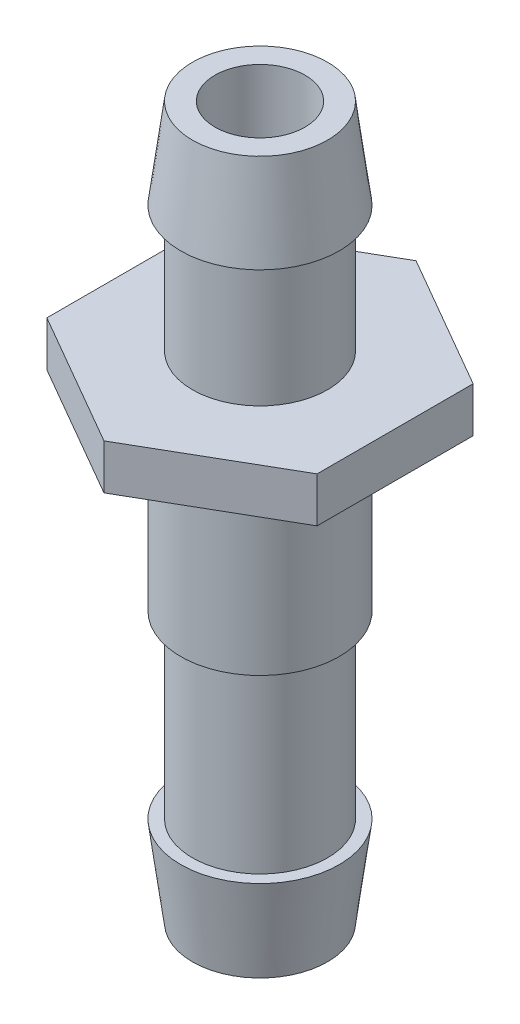
ISO-10303-21;
HEADER;
FILE_DESCRIPTION(('STEP AP214'),'2;1');
FILE_NAME('part.step','',(''),(''),'','','');
FILE_SCHEMA(('AUTOMOTIVE_DESIGN { 1 0 10303 214 1 1 1 1 }'));
ENDSEC;
DATA;
#1=APPLICATION_CONTEXT('core data for automotive mechanical design processes');
#2=APPLICATION_PROTOCOL_DEFINITION('international standard','automotive_design',2000,#1);
#3=PRODUCT_CONTEXT('',#1,'mechanical');
#4=PRODUCT('Part','Part','',(#3));
#5=PRODUCT_RELATED_PRODUCT_CATEGORY('part','',(#4));
#6=PRODUCT_DEFINITION_FORMATION('','',#4);
#7=PRODUCT_DEFINITION_CONTEXT('part definition',#1,'design');
#8=PRODUCT_DEFINITION('design','',#6,#7);
#9=PRODUCT_DEFINITION_SHAPE('','',#8);
#10=(LENGTH_UNIT() NAMED_UNIT(*) SI_UNIT(.MILLI.,.METRE.));
#11=(NAMED_UNIT(*) PLANE_ANGLE_UNIT() SI_UNIT($,.RADIAN.));
#12=(NAMED_UNIT(*) SI_UNIT($,.STERADIAN.) SOLID_ANGLE_UNIT());
#13=UNCERTAINTY_MEASURE_WITH_UNIT(LENGTH_MEASURE(1.E-05),#10,'distance_accuracy_value','');
#14=(GEOMETRIC_REPRESENTATION_CONTEXT(3) GLOBAL_UNCERTAINTY_ASSIGNED_CONTEXT((#13)) GLOBAL_UNIT_ASSIGNED_CONTEXT((#10,
#11,#12)) REPRESENTATION_CONTEXT('',''));
#15=CARTESIAN_POINT('',(0.,0.,0.));
#16=DIRECTION('',(0.,0.,1.));
#17=DIRECTION('',(1.,0.,0.));
#18=AXIS2_PLACEMENT_3D('',#15,#16,#17);
#19=CARTESIAN_POINT('',(0.,-34.925,0.));
#20=DIRECTION('',(0.,1.,0.));
#21=DIRECTION('',(0.,0.,1.));
#22=AXIS2_PLACEMENT_3D('',#19,#20,#21);
#23=CYLINDRICAL_SURFACE('',#22,4.7625);
#24=CARTESIAN_POINT('',(0.,-15.875,0.));
#25=DIRECTION('',(0.,-1.,0.));
#26=DIRECTION('',(0.,0.,-1.));
#27=AXIS2_PLACEMENT_3D('',#24,#25,#26);
#28=CIRCLE('',#27,4.7625);
#29=CARTESIAN_POINT('',(0.,-15.875,-4.7625));
#30=VERTEX_POINT('',#29);
#31=EDGE_CURVE('E254',#30,#30,#28,.T.);
#32=ORIENTED_EDGE('',*,*,#31,.T.);
#33=EDGE_LOOP('',(#32));
#34=FACE_BOUND('',#33,.T.);
#35=CARTESIAN_POINT('',(0.,-28.575,0.));
#36=DIRECTION('',(0.,-1.,0.));
#37=DIRECTION('',(0.,0.,-1.));
#38=AXIS2_PLACEMENT_3D('',#35,#36,#37);
#39=CIRCLE('',#38,4.7625);
#40=CARTESIAN_POINT('',(0.,-28.575,-4.7625));
#41=VERTEX_POINT('',#40);
#42=EDGE_CURVE('E11',#41,#41,#39,.T.);
#43=ORIENTED_EDGE('',*,*,#42,.F.);
#44=EDGE_LOOP('',(#43));
#45=FACE_BOUND('',#44,.T.);
#46=ADVANCED_FACE('F34',(#34,#45),#23,.T.);
#47=CARTESIAN_POINT('',(0.,15.24,0.));
#48=DIRECTION('',(0.,-1.,0.));
#49=DIRECTION('',(0.,0.,-1.));
#50=AXIS2_PLACEMENT_3D('',#47,#48,#49);
#51=CYLINDRICAL_SURFACE('',#50,4.7625);
#52=CARTESIAN_POINT('',(0.,0.,0.));
#53=DIRECTION('',(0.,1.,0.));
#54=DIRECTION('',(0.,0.,1.));
#55=AXIS2_PLACEMENT_3D('',#52,#53,#54);
#56=CIRCLE('',#55,4.7625);
#57=CARTESIAN_POINT('',(0.,0.,4.7625));
#58=VERTEX_POINT('',#57);
#59=EDGE_CURVE('E106',#58,#58,#56,.T.);
#60=ORIENTED_EDGE('',*,*,#59,.T.);
#61=EDGE_LOOP('',(#60));
#62=FACE_BOUND('',#61,.T.);
#63=CARTESIAN_POINT('',(0.,8.89,0.));
#64=DIRECTION('',(0.,1.,0.));
#65=DIRECTION('',(0.,0.,1.));
#66=AXIS2_PLACEMENT_3D('',#63,#64,#65);
#67=CIRCLE('',#66,4.7625);
#68=CARTESIAN_POINT('',(0.,8.89,4.7625));
#69=VERTEX_POINT('',#68);
#70=EDGE_CURVE('E42',#69,#69,#67,.T.);
#71=ORIENTED_EDGE('',*,*,#70,.F.);
#72=EDGE_LOOP('',(#71));
#73=FACE_BOUND('',#72,.T.);
#74=ADVANCED_FACE('F36',(#62,#73),#51,.T.);
#75=CARTESIAN_POINT('',(-19.05,-3.175,0.));
#76=DIRECTION('',(0.,1.,0.));
#77=DIRECTION('',(0.,0.,1.));
#78=AXIS2_PLACEMENT_3D('',#75,#76,#77);
#79=PLANE('',#78);
#80=CARTESIAN_POINT('',(0.,-3.175,0.));
#81=DIRECTION('',(0.,-1.,0.));
#82=DIRECTION('',(0.,0.,-1.));
#83=AXIS2_PLACEMENT_3D('',#80,#81,#82);
#84=CIRCLE('',#83,7.366);
#85=CARTESIAN_POINT('',(0.,-3.175,-7.366));
#86=VERTEX_POINT('',#85);
#87=EDGE_CURVE('E271',#86,#86,#84,.T.);
#88=ORIENTED_EDGE('',*,*,#87,.F.);
#89=EDGE_LOOP('',(#88));
#90=FACE_BOUND('',#89,.T.);
#91=DIRECTION('',(-0.866025403784439,0.,-0.5));
#92=VECTOR('',#91,1.);
#93=CARTESIAN_POINT('',(0.,-3.175,10.9985226280624));
#94=LINE('',#93,#92);
#95=CARTESIAN_POINT('',(0.,-3.175,10.9985226280624));
#96=VERTEX_POINT('',#95);
#97=CARTESIAN_POINT('',(-9.525,-3.175,5.49926131403119));
#98=VERTEX_POINT('',#97);
#99=EDGE_CURVE('E126',#96,#98,#94,.T.);
#100=ORIENTED_EDGE('',*,*,#99,.T.);
#101=DIRECTION('',(0.,0.,-1.));
#102=VECTOR('',#101,1.);
#103=CARTESIAN_POINT('',(-9.525,-3.175,5.49926131403119));
#104=LINE('',#103,#102);
#105=CARTESIAN_POINT('',(-9.525,-3.175,-5.49926131403118));
#106=VERTEX_POINT('',#105);
#107=EDGE_CURVE('E103',#98,#106,#104,.T.);
#108=ORIENTED_EDGE('',*,*,#107,.T.);
#109=DIRECTION('',(0.866025403784438,0.,-0.5));
#110=VECTOR('',#109,1.);
#111=CARTESIAN_POINT('',(0.,-3.175,-10.9985226280624));
#112=LINE('',#111,#110);
#113=CARTESIAN_POINT('',(0.,-3.175,-10.9985226280624));
#114=VERTEX_POINT('',#113);
#115=EDGE_CURVE('E129',#106,#114,#112,.T.);
#116=ORIENTED_EDGE('',*,*,#115,.T.);
#117=DIRECTION('',(0.866025403784438,0.,0.5));
#118=VECTOR('',#117,1.);
#119=CARTESIAN_POINT('',(0.,-3.175,-10.9985226280624));
#120=LINE('',#119,#118);
#121=CARTESIAN_POINT('',(9.525,-3.175,-5.49926131403118));
#122=VERTEX_POINT('',#121);
#123=EDGE_CURVE('E131',#114,#122,#120,.T.);
#124=ORIENTED_EDGE('',*,*,#123,.T.);
#125=DIRECTION('',(0.,0.,1.));
#126=VECTOR('',#125,1.);
#127=CARTESIAN_POINT('',(9.525,-3.175,5.49926131403119));
#128=LINE('',#127,#126);
#129=CARTESIAN_POINT('',(9.525,-3.175,5.49926131403119));
#130=VERTEX_POINT('',#129);
#131=EDGE_CURVE('E54',#122,#130,#128,.T.);
#132=ORIENTED_EDGE('',*,*,#131,.T.);
#133=DIRECTION('',(-0.866025403784439,0.,0.5));
#134=VECTOR('',#133,1.);
#135=CARTESIAN_POINT('',(0.,-3.175,10.9985226280624));
#136=LINE('',#135,#134);
#137=EDGE_CURVE('E49',#130,#96,#136,.T.);
#138=ORIENTED_EDGE('',*,*,#137,.T.);
#139=EDGE_LOOP('',(#100,#108,#116,#124,#132,#138));
#140=FACE_BOUND('',#139,.T.);
#141=ADVANCED_FACE('F157',(#90,#140),#79,.F.);
#142=CARTESIAN_POINT('',(0.,15.24,0.));
#143=DIRECTION('',(0.,1.,0.));
#144=DIRECTION('',(0.,0.,1.));
#145=AXIS2_PLACEMENT_3D('',#142,#143,#144);
#146=PLANE('',#145);
#147=CARTESIAN_POINT('',(0.,15.24,0.));
#148=DIRECTION('',(0.,1.,0.));
#149=DIRECTION('',(0.,0.,1.));
#150=AXIS2_PLACEMENT_3D('',#147,#148,#149);
#151=CIRCLE('',#150,4.7625);
#152=CARTESIAN_POINT('',(0.,15.24,4.7625));
#153=VERTEX_POINT('',#152);
#154=EDGE_CURVE('E206',#153,#153,#151,.T.);
#155=ORIENTED_EDGE('',*,*,#154,.T.);
#156=EDGE_LOOP('',(#155));
#157=FACE_BOUND('',#156,.T.);
#158=CARTESIAN_POINT('',(0.,15.24,0.));
#159=DIRECTION('',(0.,1.,0.));
#160=DIRECTION('',(0.,0.,1.));
#161=AXIS2_PLACEMENT_3D('',#158,#159,#160);
#162=CIRCLE('',#161,3.175);
#163=CARTESIAN_POINT('',(0.,15.24,3.175));
#164=VERTEX_POINT('',#163);
#165=EDGE_CURVE('E148',#164,#164,#162,.T.);
#166=ORIENTED_EDGE('',*,*,#165,.F.);
#167=EDGE_LOOP('',(#166));
#168=FACE_BOUND('',#167,.T.);
#169=ADVANCED_FACE('F163',(#157,#168),#146,.T.);
#170=CARTESIAN_POINT('',(0.,15.24,0.));
#171=DIRECTION('',(0.,-1.,0.));
#172=DIRECTION('',(0.,0.,-1.));
#173=AXIS2_PLACEMENT_3D('',#170,#171,#172);
#174=CYLINDRICAL_SURFACE('',#173,3.175);
#175=ORIENTED_EDGE('',*,*,#165,.T.);
#176=EDGE_LOOP('',(#175));
#177=FACE_BOUND('',#176,.T.);
#178=CARTESIAN_POINT('',(0.,-34.925,0.));
#179=DIRECTION('',(0.,-1.,0.));
#180=DIRECTION('',(0.,0.,-1.));
#181=AXIS2_PLACEMENT_3D('',#178,#179,#180);
#182=CIRCLE('',#181,3.175);
#183=CARTESIAN_POINT('',(0.,-34.925,-3.175));
#184=VERTEX_POINT('',#183);
#185=EDGE_CURVE('E112',#184,#184,#182,.T.);
#186=ORIENTED_EDGE('',*,*,#185,.T.);
#187=EDGE_LOOP('',(#186));
#188=FACE_BOUND('',#187,.T.);
#189=ADVANCED_FACE('F170',(#177,#188),#174,.F.);
#190=CARTESIAN_POINT('',(-19.05,0.,0.));
#191=DIRECTION('',(0.,1.,0.));
#192=DIRECTION('',(0.,0.,1.));
#193=AXIS2_PLACEMENT_3D('',#190,#191,#192);
#194=PLANE('',#193);
#195=DIRECTION('',(-0.866025403784439,0.,-0.5));
#196=VECTOR('',#195,1.);
#197=CARTESIAN_POINT('',(0.,0.,10.9985226280624));
#198=LINE('',#197,#196);
#199=CARTESIAN_POINT('',(0.,0.,10.9985226280624));
#200=VERTEX_POINT('',#199);
#201=CARTESIAN_POINT('',(-9.525,0.,5.49926131403119));
#202=VERTEX_POINT('',#201);
#203=EDGE_CURVE('E93',#200,#202,#198,.T.);
#204=ORIENTED_EDGE('',*,*,#203,.F.);
#205=DIRECTION('',(-0.866025403784439,0.,0.5));
#206=VECTOR('',#205,1.);
#207=CARTESIAN_POINT('',(0.,0.,10.9985226280624));
#208=LINE('',#207,#206);
#209=CARTESIAN_POINT('',(9.525,0.,5.49926131403119));
#210=VERTEX_POINT('',#209);
#211=EDGE_CURVE('E124',#210,#200,#208,.T.);
#212=ORIENTED_EDGE('',*,*,#211,.F.);
#213=DIRECTION('',(0.,0.,1.));
#214=VECTOR('',#213,1.);
#215=CARTESIAN_POINT('',(9.525,0.,5.49926131403119));
#216=LINE('',#215,#214);
#217=CARTESIAN_POINT('',(9.525,0.,-5.49926131403118));
#218=VERTEX_POINT('',#217);
#219=EDGE_CURVE('E122',#218,#210,#216,.T.);
#220=ORIENTED_EDGE('',*,*,#219,.F.);
#221=DIRECTION('',(0.866025403784438,0.,0.5));
#222=VECTOR('',#221,1.);
#223=CARTESIAN_POINT('',(0.,0.,-10.9985226280624));
#224=LINE('',#223,#222);
#225=CARTESIAN_POINT('',(0.,0.,-10.9985226280624));
#226=VERTEX_POINT('',#225);
#227=EDGE_CURVE('E120',#226,#218,#224,.T.);
#228=ORIENTED_EDGE('',*,*,#227,.F.);
#229=DIRECTION('',(0.866025403784438,0.,-0.5));
#230=VECTOR('',#229,1.);
#231=CARTESIAN_POINT('',(0.,0.,-10.9985226280624));
#232=LINE('',#231,#230);
#233=CARTESIAN_POINT('',(-9.525,0.,-5.49926131403118));
#234=VERTEX_POINT('',#233);
#235=EDGE_CURVE('E95',#234,#226,#232,.T.);
#236=ORIENTED_EDGE('',*,*,#235,.F.);
#237=DIRECTION('',(0.,0.,-1.));
#238=VECTOR('',#237,1.);
#239=CARTESIAN_POINT('',(-9.525,0.,5.49926131403119));
#240=LINE('',#239,#238);
#241=EDGE_CURVE('E87',#202,#234,#240,.T.);
#242=ORIENTED_EDGE('',*,*,#241,.F.);
#243=EDGE_LOOP('',(#204,#212,#220,#228,#236,#242));
#244=FACE_BOUND('',#243,.T.);
#245=ORIENTED_EDGE('',*,*,#59,.F.);
#246=EDGE_LOOP('',(#245));
#247=FACE_BOUND('',#246,.T.);
#248=ADVANCED_FACE('F89',(#244,#247),#194,.T.);
#249=CARTESIAN_POINT('',(0.,-3.175,10.9985226280624));
#250=DIRECTION('',(0.5,0.,-0.866025403784439));
#251=DIRECTION('',(-0.866025403784439,0.,-0.5));
#252=AXIS2_PLACEMENT_3D('',#249,#250,#251);
#253=PLANE('',#252);
#254=ORIENTED_EDGE('',*,*,#203,.T.);
#255=DIRECTION('',(0.,1.,0.));
#256=VECTOR('',#255,1.);
#257=CARTESIAN_POINT('',(-9.525,-3.175,5.49926131403119));
#258=LINE('',#257,#256);
#259=EDGE_CURVE('E101',#98,#202,#258,.T.);
#260=ORIENTED_EDGE('',*,*,#259,.F.);
#261=ORIENTED_EDGE('',*,*,#99,.F.);
#262=DIRECTION('',(0.,1.,0.));
#263=VECTOR('',#262,1.);
#264=CARTESIAN_POINT('',(0.,-3.175,10.9985226280624));
#265=LINE('',#264,#263);
#266=EDGE_CURVE('E111',#96,#200,#265,.T.);
#267=ORIENTED_EDGE('',*,*,#266,.T.);
#268=EDGE_LOOP('',(#254,#260,#261,#267));
#269=FACE_BOUND('',#268,.T.);
#270=ADVANCED_FACE('F110',(#269),#253,.F.);
#271=CARTESIAN_POINT('',(-9.525,-3.175,5.49926131403119));
#272=DIRECTION('',(1.,0.,0.));
#273=DIRECTION('',(0.,0.,-1.));
#274=AXIS2_PLACEMENT_3D('',#271,#272,#273);
#275=PLANE('',#274);
#276=ORIENTED_EDGE('',*,*,#241,.T.);
#277=DIRECTION('',(0.,1.,0.));
#278=VECTOR('',#277,1.);
#279=CARTESIAN_POINT('',(-9.525,-3.175,-5.49926131403118));
#280=LINE('',#279,#278);
#281=EDGE_CURVE('E107',#106,#234,#280,.T.);
#282=ORIENTED_EDGE('',*,*,#281,.F.);
#283=ORIENTED_EDGE('',*,*,#107,.F.);
#284=ORIENTED_EDGE('',*,*,#259,.T.);
#285=EDGE_LOOP('',(#276,#282,#283,#284));
#286=FACE_BOUND('',#285,.T.);
#287=ADVANCED_FACE('F102',(#286),#275,.F.);
#288=CARTESIAN_POINT('',(0.,-3.175,-10.9985226280624));
#289=DIRECTION('',(0.5,0.,0.866025403784438));
#290=DIRECTION('',(0.866025403784439,0.,-0.5));
#291=AXIS2_PLACEMENT_3D('',#288,#289,#290);
#292=PLANE('',#291);
#293=ORIENTED_EDGE('',*,*,#235,.T.);
#294=DIRECTION('',(0.,1.,0.));
#295=VECTOR('',#294,1.);
#296=CARTESIAN_POINT('',(0.,-3.175,-10.9985226280624));
#297=LINE('',#296,#295);
#298=EDGE_CURVE('E142',#114,#226,#297,.T.);
#299=ORIENTED_EDGE('',*,*,#298,.F.);
#300=ORIENTED_EDGE('',*,*,#115,.F.);
#301=ORIENTED_EDGE('',*,*,#281,.T.);
#302=EDGE_LOOP('',(#293,#299,#300,#301));
#303=FACE_BOUND('',#302,.T.);
#304=ADVANCED_FACE('F193',(#303),#292,.F.);
#305=CARTESIAN_POINT('',(0.,-3.175,-10.9985226280624));
#306=DIRECTION('',(-0.5,0.,0.866025403784438));
#307=DIRECTION('',(0.866025403784439,0.,0.5));
#308=AXIS2_PLACEMENT_3D('',#305,#306,#307);
#309=PLANE('',#308);
#310=ORIENTED_EDGE('',*,*,#227,.T.);
#311=DIRECTION('',(0.,1.,0.));
#312=VECTOR('',#311,1.);
#313=CARTESIAN_POINT('',(9.525,-3.175,-5.49926131403118));
#314=LINE('',#313,#312);
#315=EDGE_CURVE('E139',#122,#218,#314,.T.);
#316=ORIENTED_EDGE('',*,*,#315,.F.);
#317=ORIENTED_EDGE('',*,*,#123,.F.);
#318=ORIENTED_EDGE('',*,*,#298,.T.);
#319=EDGE_LOOP('',(#310,#316,#317,#318));
#320=FACE_BOUND('',#319,.T.);
#321=ADVANCED_FACE('F189',(#320),#309,.F.);
#322=CARTESIAN_POINT('',(9.525,-3.175,5.49926131403119));
#323=DIRECTION('',(-1.,0.,0.));
#324=DIRECTION('',(0.,0.,1.));
#325=AXIS2_PLACEMENT_3D('',#322,#323,#324);
#326=PLANE('',#325);
#327=ORIENTED_EDGE('',*,*,#219,.T.);
#328=DIRECTION('',(0.,1.,0.));
#329=VECTOR('',#328,1.);
#330=CARTESIAN_POINT('',(9.525,-3.175,5.49926131403119));
#331=LINE('',#330,#329);
#332=EDGE_CURVE('E136',#130,#210,#331,.T.);
#333=ORIENTED_EDGE('',*,*,#332,.F.);
#334=ORIENTED_EDGE('',*,*,#131,.F.);
#335=ORIENTED_EDGE('',*,*,#315,.T.);
#336=EDGE_LOOP('',(#327,#333,#334,#335));
#337=FACE_BOUND('',#336,.T.);
#338=ADVANCED_FACE('F185',(#337),#326,.F.);
#339=CARTESIAN_POINT('',(0.,-3.175,10.9985226280624));
#340=DIRECTION('',(-0.5,0.,-0.866025403784439));
#341=DIRECTION('',(-0.866025403784439,0.,0.5));
#342=AXIS2_PLACEMENT_3D('',#339,#340,#341);
#343=PLANE('',#342);
#344=ORIENTED_EDGE('',*,*,#211,.T.);
#345=ORIENTED_EDGE('',*,*,#266,.F.);
#346=ORIENTED_EDGE('',*,*,#137,.F.);
#347=ORIENTED_EDGE('',*,*,#332,.T.);
#348=EDGE_LOOP('',(#344,#345,#346,#347));
#349=FACE_BOUND('',#348,.T.);
#350=ADVANCED_FACE('F181',(#349),#343,.F.);
#351=CARTESIAN_POINT('',(0.,-34.925,0.));
#352=DIRECTION('',(0.,-1.,0.));
#353=DIRECTION('',(0.,0.,-1.));
#354=AXIS2_PLACEMENT_3D('',#351,#352,#353);
#355=PLANE('',#354);
#356=CARTESIAN_POINT('',(0.,-34.925,0.));
#357=DIRECTION('',(0.,1.,0.));
#358=DIRECTION('',(0.,0.,1.));
#359=AXIS2_PLACEMENT_3D('',#356,#357,#358);
#360=CIRCLE('',#359,4.76249999999999);
#361=CARTESIAN_POINT('',(0.,-34.925,4.76249999999999));
#362=VERTEX_POINT('',#361);
#363=EDGE_CURVE('E256',#362,#362,#360,.T.);
#364=ORIENTED_EDGE('',*,*,#363,.F.);
#365=EDGE_LOOP('',(#364));
#366=FACE_BOUND('',#365,.T.);
#367=ORIENTED_EDGE('',*,*,#185,.F.);
#368=EDGE_LOOP('',(#367));
#369=FACE_BOUND('',#368,.T.);
#370=ADVANCED_FACE('F184',(#366,#369),#355,.T.);
#371=CARTESIAN_POINT('',(0.,-1.5875,0.));
#372=DIRECTION('',(0.,-1.,0.));
#373=DIRECTION('',(0.,0.,-1.));
#374=AXIS2_PLACEMENT_3D('',#371,#372,#373);
#375=CYLINDRICAL_SURFACE('',#374,7.366);
#376=CARTESIAN_POINT('',(0.,-1.5875,0.));
#377=DIRECTION('',(0.,-1.,0.));
#378=DIRECTION('',(0.,0.,-1.));
#379=AXIS2_PLACEMENT_3D('',#376,#377,#378);
#380=CIRCLE('',#379,7.366);
#381=CARTESIAN_POINT('',(0.,-1.5875,-7.366));
#382=VERTEX_POINT('',#381);
#383=EDGE_CURVE('E115',#382,#382,#380,.T.);
#384=ORIENTED_EDGE('',*,*,#383,.F.);
#385=EDGE_LOOP('',(#384));
#386=FACE_BOUND('',#385,.T.);
#387=ORIENTED_EDGE('',*,*,#87,.T.);
#388=EDGE_LOOP('',(#387));
#389=FACE_BOUND('',#388,.T.);
#390=ADVANCED_FACE('F212',(#386,#389),#375,.F.);
#391=CARTESIAN_POINT('',(0.,-1.5875,0.));
#392=DIRECTION('',(0.,-1.,0.));
#393=DIRECTION('',(0.,0.,-1.));
#394=AXIS2_PLACEMENT_3D('',#391,#392,#393);
#395=PLANE('',#394);
#396=CARTESIAN_POINT('',(0.,-1.5875,0.));
#397=DIRECTION('',(0.,-1.,0.));
#398=DIRECTION('',(0.,0.,-1.));
#399=AXIS2_PLACEMENT_3D('',#396,#397,#398);
#400=CIRCLE('',#399,5.588);
#401=CARTESIAN_POINT('',(0.,-1.5875,-5.588));
#402=VERTEX_POINT('',#401);
#403=EDGE_CURVE('E268',#402,#402,#400,.T.);
#404=ORIENTED_EDGE('',*,*,#403,.F.);
#405=EDGE_LOOP('',(#404));
#406=FACE_BOUND('',#405,.T.);
#407=ORIENTED_EDGE('',*,*,#383,.T.);
#408=EDGE_LOOP('',(#407));
#409=FACE_BOUND('',#408,.T.);
#410=ADVANCED_FACE('F217',(#406,#409),#395,.T.);
#411=CARTESIAN_POINT('',(0.,-1.5875,0.));
#412=DIRECTION('',(0.,-1.,0.));
#413=DIRECTION('',(0.,0.,-1.));
#414=AXIS2_PLACEMENT_3D('',#411,#412,#413);
#415=CYLINDRICAL_SURFACE('',#414,5.588);
#416=ORIENTED_EDGE('',*,*,#403,.T.);
#417=EDGE_LOOP('',(#416));
#418=FACE_BOUND('',#417,.T.);
#419=CARTESIAN_POINT('',(0.,-15.875,0.));
#420=DIRECTION('',(0.,-1.,0.));
#421=DIRECTION('',(0.,0.,-1.));
#422=AXIS2_PLACEMENT_3D('',#419,#420,#421);
#423=CIRCLE('',#422,5.588);
#424=CARTESIAN_POINT('',(0.,-15.875,-5.588));
#425=VERTEX_POINT('',#424);
#426=EDGE_CURVE('E251',#425,#425,#423,.T.);
#427=ORIENTED_EDGE('',*,*,#426,.F.);
#428=EDGE_LOOP('',(#427));
#429=FACE_BOUND('',#428,.T.);
#430=ADVANCED_FACE('F224',(#418,#429),#415,.T.);
#431=CARTESIAN_POINT('',(0.,8.89,0.));
#432=DIRECTION('',(0.,1.,0.));
#433=DIRECTION('',(0.,0.,1.));
#434=AXIS2_PLACEMENT_3D('',#431,#432,#433);
#435=PLANE('',#434);
#436=ORIENTED_EDGE('',*,*,#70,.T.);
#437=EDGE_LOOP('',(#436));
#438=FACE_BOUND('',#437,.T.);
#439=CARTESIAN_POINT('',(0.,8.89,0.));
#440=DIRECTION('',(0.,1.,0.));
#441=DIRECTION('',(0.,0.,1.));
#442=AXIS2_PLACEMENT_3D('',#439,#440,#441);
#443=CIRCLE('',#442,5.588);
#444=CARTESIAN_POINT('',(0.,8.89,5.588));
#445=VERTEX_POINT('',#444);
#446=EDGE_CURVE('E264',#445,#445,#443,.T.);
#447=ORIENTED_EDGE('',*,*,#446,.F.);
#448=EDGE_LOOP('',(#447));
#449=FACE_BOUND('',#448,.T.);
#450=ADVANCED_FACE('F153',(#438,#449),#435,.F.);
#451=CARTESIAN_POINT('',(0.,-28.575,0.));
#452=DIRECTION('',(0.,-1.,0.));
#453=DIRECTION('',(0.,0.,-1.));
#454=AXIS2_PLACEMENT_3D('',#451,#452,#453);
#455=PLANE('',#454);
#456=ORIENTED_EDGE('',*,*,#42,.T.);
#457=EDGE_LOOP('',(#456));
#458=FACE_BOUND('',#457,.T.);
#459=CARTESIAN_POINT('',(0.,-28.575,0.));
#460=DIRECTION('',(0.,1.,0.));
#461=DIRECTION('',(0.,0.,1.));
#462=AXIS2_PLACEMENT_3D('',#459,#460,#461);
#463=CIRCLE('',#462,5.588);
#464=CARTESIAN_POINT('',(0.,-28.575,5.588));
#465=VERTEX_POINT('',#464);
#466=EDGE_CURVE('E261',#465,#465,#463,.T.);
#467=ORIENTED_EDGE('',*,*,#466,.T.);
#468=EDGE_LOOP('',(#467));
#469=FACE_BOUND('',#468,.T.);
#470=ADVANCED_FACE('F231',(#458,#469),#455,.F.);
#471=CARTESIAN_POINT('',(0.,8.89,0.));
#472=DIRECTION('',(0.,-1.,0.));
#473=DIRECTION('',(0.,0.,-1.));
#474=AXIS2_PLACEMENT_3D('',#471,#472,#473);
#475=CONICAL_SURFACE('',#474,5.588,0.129275004048143);
#476=ORIENTED_EDGE('',*,*,#154,.F.);
#477=EDGE_LOOP('',(#476));
#478=FACE_BOUND('',#477,.T.);
#479=ORIENTED_EDGE('',*,*,#446,.T.);
#480=EDGE_LOOP('',(#479));
#481=FACE_BOUND('',#480,.T.);
#482=ADVANCED_FACE('F234',(#478,#481),#475,.T.);
#483=CARTESIAN_POINT('',(0.,-34.925,0.));
#484=DIRECTION('',(0.,1.,0.));
#485=DIRECTION('',(0.,0.,1.));
#486=AXIS2_PLACEMENT_3D('',#483,#484,#485);
#487=CONICAL_SURFACE('',#486,4.76249999999999,0.129275004048143);
#488=ORIENTED_EDGE('',*,*,#466,.F.);
#489=EDGE_LOOP('',(#488));
#490=FACE_BOUND('',#489,.T.);
#491=ORIENTED_EDGE('',*,*,#363,.T.);
#492=EDGE_LOOP('',(#491));
#493=FACE_BOUND('',#492,.T.);
#494=ADVANCED_FACE('F238',(#490,#493),#487,.T.);
#495=CARTESIAN_POINT('',(0.,-15.875,0.));
#496=DIRECTION('',(0.,-1.,0.));
#497=DIRECTION('',(0.,0.,-1.));
#498=AXIS2_PLACEMENT_3D('',#495,#496,#497);
#499=PLANE('',#498);
#500=ORIENTED_EDGE('',*,*,#426,.T.);
#501=EDGE_LOOP('',(#500));
#502=FACE_BOUND('',#501,.T.);
#503=ORIENTED_EDGE('',*,*,#31,.F.);
#504=EDGE_LOOP('',(#503));
#505=FACE_BOUND('',#504,.T.);
#506=ADVANCED_FACE('F242',(#502,#505),#499,.T.);
#507=CLOSED_SHELL('',(#46,#74,#141,#169,#189,#248,#270,#287,#304,#321,#338,#350,#370,#390,#410,
#430,#450,#470,#482,#494,#506));
#508=MANIFOLD_SOLID_BREP('B2',#507);
#509=ADVANCED_BREP_SHAPE_REPRESENTATION('',(#18,#508),#14);
#510=SHAPE_DEFINITION_REPRESENTATION(#9,#509);
ENDSEC;
END-ISO-10303-21;
